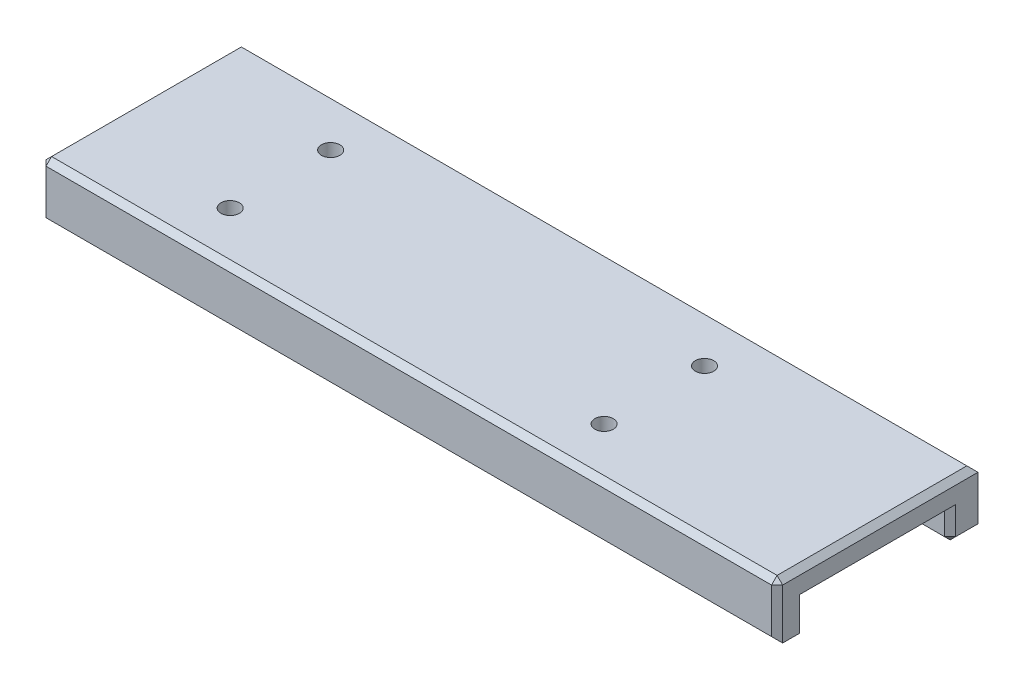
ISO-10303-21;
HEADER;
FILE_DESCRIPTION(('STEP AP214'),'2;1');
FILE_NAME('part.step','',(''),(''),'','','');
FILE_SCHEMA(('AUTOMOTIVE_DESIGN { 1 0 10303 214 1 1 1 1 }'));
ENDSEC;
DATA;
#1=APPLICATION_CONTEXT('core data for automotive mechanical design processes');
#2=APPLICATION_PROTOCOL_DEFINITION('international standard','automotive_design',2000,#1);
#3=PRODUCT_CONTEXT('',#1,'mechanical');
#4=PRODUCT('Part','Part','',(#3));
#5=PRODUCT_RELATED_PRODUCT_CATEGORY('part','',(#4));
#6=PRODUCT_DEFINITION_FORMATION('','',#4);
#7=PRODUCT_DEFINITION_CONTEXT('part definition',#1,'design');
#8=PRODUCT_DEFINITION('design','',#6,#7);
#9=PRODUCT_DEFINITION_SHAPE('','',#8);
#10=(LENGTH_UNIT() NAMED_UNIT(*) SI_UNIT(.MILLI.,.METRE.));
#11=(NAMED_UNIT(*) PLANE_ANGLE_UNIT() SI_UNIT($,.RADIAN.));
#12=(NAMED_UNIT(*) SI_UNIT($,.STERADIAN.) SOLID_ANGLE_UNIT());
#13=UNCERTAINTY_MEASURE_WITH_UNIT(LENGTH_MEASURE(1.E-05),#10,'distance_accuracy_value','');
#14=(GEOMETRIC_REPRESENTATION_CONTEXT(3) GLOBAL_UNCERTAINTY_ASSIGNED_CONTEXT((#13)) GLOBAL_UNIT_ASSIGNED_CONTEXT((#10,
#11,#12)) REPRESENTATION_CONTEXT('',''));
#15=CARTESIAN_POINT('',(0.,0.,0.));
#16=DIRECTION('',(0.,0.,1.));
#17=DIRECTION('',(1.,0.,0.));
#18=AXIS2_PLACEMENT_3D('',#15,#16,#17);
#19=CARTESIAN_POINT('',(0.,-5.,0.));
#20=DIRECTION('',(0.,-1.,0.));
#21=DIRECTION('',(0.,0.,-1.));
#22=AXIS2_PLACEMENT_3D('',#19,#20,#21);
#23=PLANE('',#22);
#24=DIRECTION('',(0.,0.,1.));
#25=VECTOR('',#24,1.);
#26=CARTESIAN_POINT('',(-66.,-5.,18.));
#27=LINE('',#26,#25);
#28=CARTESIAN_POINT('',(-66.,-5.,14.));
#29=VERTEX_POINT('',#28);
#30=CARTESIAN_POINT('',(-66.,-5.,17.));
#31=VERTEX_POINT('',#30);
#32=EDGE_CURVE('E188',#29,#31,#27,.T.);
#33=ORIENTED_EDGE('',*,*,#32,.F.);
#34=DIRECTION('',(1.,0.,0.));
#35=VECTOR('',#34,1.);
#36=CARTESIAN_POINT('',(66.,-5.,14.));
#37=LINE('',#36,#35);
#38=CARTESIAN_POINT('',(66.,-5.,14.));
#39=VERTEX_POINT('',#38);
#40=EDGE_CURVE('E173',#29,#39,#37,.T.);
#41=ORIENTED_EDGE('',*,*,#40,.T.);
#42=DIRECTION('',(0.,0.,-1.));
#43=VECTOR('',#42,1.);
#44=CARTESIAN_POINT('',(66.,-5.,18.));
#45=LINE('',#44,#43);
#46=CARTESIAN_POINT('',(66.,-5.,17.));
#47=VERTEX_POINT('',#46);
#48=EDGE_CURVE('E204',#47,#39,#45,.T.);
#49=ORIENTED_EDGE('',*,*,#48,.F.);
#50=DIRECTION('',(-1.,0.,0.));
#51=VECTOR('',#50,1.);
#52=CARTESIAN_POINT('',(-66.,-5.,17.));
#53=LINE('',#52,#51);
#54=EDGE_CURVE('E182',#47,#31,#53,.T.);
#55=ORIENTED_EDGE('',*,*,#54,.T.);
#56=EDGE_LOOP('',(#33,#41,#49,#55));
#57=FACE_BOUND('',#56,.T.);
#58=ADVANCED_FACE('F35',(#57),#23,.T.);
#59=CARTESIAN_POINT('',(66.,5.,18.));
#60=DIRECTION('',(-1.,0.,0.));
#61=DIRECTION('',(0.,0.,1.));
#62=AXIS2_PLACEMENT_3D('',#59,#60,#61);
#63=PLANE('',#62);
#64=DIRECTION('',(0.,-1.,0.));
#65=VECTOR('',#64,1.);
#66=CARTESIAN_POINT('',(66.,5.,-14.));
#67=LINE('',#66,#65);
#68=CARTESIAN_POINT('',(66.,1.00000000000001,-14.));
#69=VERTEX_POINT('',#68);
#70=CARTESIAN_POINT('',(66.,-3.99999999999999,-14.));
#71=VERTEX_POINT('',#70);
#72=EDGE_CURVE('E252',#69,#71,#67,.T.);
#73=ORIENTED_EDGE('',*,*,#72,.T.);
#74=DIRECTION('',(0.,0.,-1.));
#75=VECTOR('',#74,1.);
#76=CARTESIAN_POINT('',(66.,-3.99999999999999,-18.));
#77=LINE('',#76,#75);
#78=CARTESIAN_POINT('',(66.,-3.99999999999998,-18.));
#79=VERTEX_POINT('',#78);
#80=EDGE_CURVE('E254',#71,#79,#77,.T.);
#81=ORIENTED_EDGE('',*,*,#80,.T.);
#82=DIRECTION('',(0.,-1.,0.));
#83=VECTOR('',#82,1.);
#84=CARTESIAN_POINT('',(66.,5.,-18.));
#85=LINE('',#84,#83);
#86=CARTESIAN_POINT('',(66.,4.,-18.));
#87=VERTEX_POINT('',#86);
#88=EDGE_CURVE('E201',#87,#79,#85,.T.);
#89=ORIENTED_EDGE('',*,*,#88,.F.);
#90=DIRECTION('',(0.,0.,1.));
#91=VECTOR('',#90,1.);
#92=CARTESIAN_POINT('',(66.,4.,18.));
#93=LINE('',#92,#91);
#94=CARTESIAN_POINT('',(66.,4.,17.));
#95=VERTEX_POINT('',#94);
#96=EDGE_CURVE('E181',#87,#95,#93,.T.);
#97=ORIENTED_EDGE('',*,*,#96,.T.);
#98=DIRECTION('',(0.,-1.,0.));
#99=VECTOR('',#98,1.);
#100=CARTESIAN_POINT('',(66.,5.,17.));
#101=LINE('',#100,#99);
#102=EDGE_CURVE('E246',#95,#47,#101,.T.);
#103=ORIENTED_EDGE('',*,*,#102,.T.);
#104=ORIENTED_EDGE('',*,*,#48,.T.);
#105=DIRECTION('',(0.,1.,0.));
#106=VECTOR('',#105,1.);
#107=CARTESIAN_POINT('',(66.,5.,14.));
#108=LINE('',#107,#106);
#109=CARTESIAN_POINT('',(66.,1.00000000000001,14.));
#110=VERTEX_POINT('',#109);
#111=EDGE_CURVE('E248',#39,#110,#108,.T.);
#112=ORIENTED_EDGE('',*,*,#111,.T.);
#113=DIRECTION('',(0.,0.,-1.));
#114=VECTOR('',#113,1.);
#115=CARTESIAN_POINT('',(66.,1.00000000000001,18.));
#116=LINE('',#115,#114);
#117=EDGE_CURVE('E250',#110,#69,#116,.T.);
#118=ORIENTED_EDGE('',*,*,#117,.T.);
#119=EDGE_LOOP('',(#73,#81,#89,#97,#103,#104,#112,#118));
#120=FACE_BOUND('',#119,.T.);
#121=ADVANCED_FACE('F369',(#120),#63,.F.);
#122=CARTESIAN_POINT('',(-66.,5.,-18.));
#123=DIRECTION('',(0.,0.,1.));
#124=DIRECTION('',(1.,0.,0.));
#125=AXIS2_PLACEMENT_3D('',#122,#123,#124);
#126=PLANE('',#125);
#127=DIRECTION('',(-1.,0.,0.));
#128=VECTOR('',#127,1.);
#129=CARTESIAN_POINT('',(-66.,-5.,-18.));
#130=LINE('',#129,#128);
#131=CARTESIAN_POINT('',(65.,-5.,-18.));
#132=VERTEX_POINT('',#131);
#133=CARTESIAN_POINT('',(-65.,-5.,-18.));
#134=VERTEX_POINT('',#133);
#135=EDGE_CURVE('E198',#132,#134,#130,.T.);
#136=ORIENTED_EDGE('',*,*,#135,.T.);
#137=DIRECTION('',(-0.707106781186543,0.707106781186552,0.));
#138=VECTOR('',#137,1.);
#139=CARTESIAN_POINT('',(-66.,-3.99999999999997,-18.));
#140=LINE('',#139,#138);
#141=CARTESIAN_POINT('',(-66.,-3.99999999999997,-18.));
#142=VERTEX_POINT('',#141);
#143=EDGE_CURVE('E232',#134,#142,#140,.T.);
#144=ORIENTED_EDGE('',*,*,#143,.T.);
#145=DIRECTION('',(0.,-1.,0.));
#146=VECTOR('',#145,1.);
#147=CARTESIAN_POINT('',(-66.,5.,-18.));
#148=LINE('',#147,#146);
#149=CARTESIAN_POINT('',(-66.,4.,-18.));
#150=VERTEX_POINT('',#149);
#151=EDGE_CURVE('E197',#150,#142,#148,.T.);
#152=ORIENTED_EDGE('',*,*,#151,.F.);
#153=DIRECTION('',(1.,0.,0.));
#154=VECTOR('',#153,1.);
#155=CARTESIAN_POINT('',(-66.,4.,-18.));
#156=LINE('',#155,#154);
#157=EDGE_CURVE('E228',#150,#87,#156,.T.);
#158=ORIENTED_EDGE('',*,*,#157,.T.);
#159=ORIENTED_EDGE('',*,*,#88,.T.);
#160=DIRECTION('',(-0.707106781186552,-0.707106781186543,0.));
#161=VECTOR('',#160,1.);
#162=CARTESIAN_POINT('',(66.,-3.99999999999999,-18.));
#163=LINE('',#162,#161);
#164=EDGE_CURVE('E230',#79,#132,#163,.T.);
#165=ORIENTED_EDGE('',*,*,#164,.T.);
#166=EDGE_LOOP('',(#136,#144,#152,#158,#159,#165));
#167=FACE_BOUND('',#166,.T.);
#168=ADVANCED_FACE('F375',(#167),#126,.F.);
#169=CARTESIAN_POINT('',(-66.,5.,18.));
#170=DIRECTION('',(1.,0.,0.));
#171=DIRECTION('',(0.,0.,-1.));
#172=AXIS2_PLACEMENT_3D('',#169,#170,#171);
#173=PLANE('',#172);
#174=DIRECTION('',(0.,0.,1.));
#175=VECTOR('',#174,1.);
#176=CARTESIAN_POINT('',(-66.,1.00000000000003,18.));
#177=LINE('',#176,#175);
#178=CARTESIAN_POINT('',(-66.,1.00000000000003,-14.));
#179=VERTEX_POINT('',#178);
#180=CARTESIAN_POINT('',(-66.,1.00000000000003,14.));
#181=VERTEX_POINT('',#180);
#182=EDGE_CURVE('E191',#179,#181,#177,.T.);
#183=ORIENTED_EDGE('',*,*,#182,.T.);
#184=DIRECTION('',(0.,-1.,0.));
#185=VECTOR('',#184,1.);
#186=CARTESIAN_POINT('',(-66.,5.,14.));
#187=LINE('',#186,#185);
#188=EDGE_CURVE('E164',#181,#29,#187,.T.);
#189=ORIENTED_EDGE('',*,*,#188,.T.);
#190=ORIENTED_EDGE('',*,*,#32,.T.);
#191=DIRECTION('',(0.,1.,0.));
#192=VECTOR('',#191,1.);
#193=CARTESIAN_POINT('',(-66.,5.,17.));
#194=LINE('',#193,#192);
#195=CARTESIAN_POINT('',(-66.,4.,17.));
#196=VERTEX_POINT('',#195);
#197=EDGE_CURVE('E212',#31,#196,#194,.T.);
#198=ORIENTED_EDGE('',*,*,#197,.T.);
#199=DIRECTION('',(0.,0.,-1.));
#200=VECTOR('',#199,1.);
#201=CARTESIAN_POINT('',(-66.,4.,18.));
#202=LINE('',#201,#200);
#203=EDGE_CURVE('E210',#196,#150,#202,.T.);
#204=ORIENTED_EDGE('',*,*,#203,.T.);
#205=ORIENTED_EDGE('',*,*,#151,.T.);
#206=DIRECTION('',(0.,0.,1.));
#207=VECTOR('',#206,1.);
#208=CARTESIAN_POINT('',(-66.,-3.99999999999997,-13.));
#209=LINE('',#208,#207);
#210=CARTESIAN_POINT('',(-66.,-3.99999999999997,-14.));
#211=VERTEX_POINT('',#210);
#212=EDGE_CURVE('E194',#142,#211,#209,.T.);
#213=ORIENTED_EDGE('',*,*,#212,.T.);
#214=DIRECTION('',(0.,1.,0.));
#215=VECTOR('',#214,1.);
#216=CARTESIAN_POINT('',(-66.,5.,-14.));
#217=LINE('',#216,#215);
#218=EDGE_CURVE('E214',#211,#179,#217,.T.);
#219=ORIENTED_EDGE('',*,*,#218,.T.);
#220=EDGE_LOOP('',(#183,#189,#190,#198,#204,#205,#213,#219));
#221=FACE_BOUND('',#220,.T.);
#222=ADVANCED_FACE('F186',(#221),#173,.F.);
#223=CARTESIAN_POINT('',(-66.,5.,18.));
#224=DIRECTION('',(0.,0.,-1.));
#225=DIRECTION('',(-1.,0.,0.));
#226=AXIS2_PLACEMENT_3D('',#223,#224,#225);
#227=PLANE('',#226);
#228=DIRECTION('',(-1.,0.,0.));
#229=VECTOR('',#228,1.);
#230=CARTESIAN_POINT('',(-66.,4.,18.));
#231=LINE('',#230,#229);
#232=CARTESIAN_POINT('',(65.,4.,18.));
#233=VERTEX_POINT('',#232);
#234=CARTESIAN_POINT('',(-65.,4.,18.));
#235=VERTEX_POINT('',#234);
#236=EDGE_CURVE('E256',#233,#235,#231,.T.);
#237=ORIENTED_EDGE('',*,*,#236,.T.);
#238=DIRECTION('',(0.,-1.,0.));
#239=VECTOR('',#238,1.);
#240=CARTESIAN_POINT('',(-65.,5.,18.));
#241=LINE('',#240,#239);
#242=CARTESIAN_POINT('',(-65.,-4.,18.));
#243=VERTEX_POINT('',#242);
#244=EDGE_CURVE('E262',#235,#243,#241,.T.);
#245=ORIENTED_EDGE('',*,*,#244,.T.);
#246=DIRECTION('',(1.,0.,0.));
#247=VECTOR('',#246,1.);
#248=CARTESIAN_POINT('',(66.,-4.,18.));
#249=LINE('',#248,#247);
#250=CARTESIAN_POINT('',(65.,-4.,18.));
#251=VERTEX_POINT('',#250);
#252=EDGE_CURVE('E260',#243,#251,#249,.T.);
#253=ORIENTED_EDGE('',*,*,#252,.T.);
#254=DIRECTION('',(0.,1.,0.));
#255=VECTOR('',#254,1.);
#256=CARTESIAN_POINT('',(65.,5.,18.));
#257=LINE('',#256,#255);
#258=EDGE_CURVE('E258',#251,#233,#257,.T.);
#259=ORIENTED_EDGE('',*,*,#258,.T.);
#260=EDGE_LOOP('',(#237,#245,#253,#259));
#261=FACE_BOUND('',#260,.T.);
#262=ADVANCED_FACE('F352',(#261),#227,.F.);
#263=CARTESIAN_POINT('',(0.,5.,0.));
#264=DIRECTION('',(0.,-1.,0.));
#265=DIRECTION('',(0.,0.,-1.));
#266=AXIS2_PLACEMENT_3D('',#263,#264,#265);
#267=PLANE('',#266);
#268=CARTESIAN_POINT('',(-40.9999999999999,5.00000000000001,-8.99999999999998));
#269=DIRECTION('',(0.,1.,0.));
#270=DIRECTION('',(0.,0.,1.));
#271=AXIS2_PLACEMENT_3D('',#268,#269,#270);
#272=CIRCLE('',#271,1.64999999999999);
#273=CARTESIAN_POINT('',(-40.9999999999999,5.00000000000001,-7.34999999999999));
#274=VERTEX_POINT('',#273);
#275=EDGE_CURVE('E748',#274,#274,#272,.T.);
#276=ORIENTED_EDGE('',*,*,#275,.F.);
#277=EDGE_LOOP('',(#276));
#278=FACE_BOUND('',#277,.T.);
#279=CARTESIAN_POINT('',(26.0000000000001,5.00000000000001,-8.99999999999998));
#280=DIRECTION('',(0.,1.,0.));
#281=DIRECTION('',(0.,0.,1.));
#282=AXIS2_PLACEMENT_3D('',#279,#280,#281);
#283=CIRCLE('',#282,1.64999999999999);
#284=CARTESIAN_POINT('',(26.0000000000001,5.00000000000001,-7.34999999999999));
#285=VERTEX_POINT('',#284);
#286=EDGE_CURVE('E744',#285,#285,#283,.T.);
#287=ORIENTED_EDGE('',*,*,#286,.F.);
#288=EDGE_LOOP('',(#287));
#289=FACE_BOUND('',#288,.T.);
#290=CARTESIAN_POINT('',(-40.9999999999999,5.00000000000001,9.00000000000001));
#291=DIRECTION('',(0.,1.,0.));
#292=DIRECTION('',(0.,0.,1.));
#293=AXIS2_PLACEMENT_3D('',#290,#291,#292);
#294=CIRCLE('',#293,1.64999999999999);
#295=CARTESIAN_POINT('',(-40.9999999999999,5.00000000000001,10.65));
#296=VERTEX_POINT('',#295);
#297=EDGE_CURVE('E740',#296,#296,#294,.T.);
#298=ORIENTED_EDGE('',*,*,#297,.F.);
#299=EDGE_LOOP('',(#298));
#300=FACE_BOUND('',#299,.T.);
#301=CARTESIAN_POINT('',(26.0000000000001,5.00000000000001,9.00000000000001));
#302=DIRECTION('',(0.,1.,0.));
#303=DIRECTION('',(0.,0.,1.));
#304=AXIS2_PLACEMENT_3D('',#301,#302,#303);
#305=CIRCLE('',#304,1.64999999999999);
#306=CARTESIAN_POINT('',(26.0000000000001,5.00000000000001,10.65));
#307=VERTEX_POINT('',#306);
#308=EDGE_CURVE('E736',#307,#307,#305,.T.);
#309=ORIENTED_EDGE('',*,*,#308,.F.);
#310=EDGE_LOOP('',(#309));
#311=FACE_BOUND('',#310,.T.);
#312=DIRECTION('',(1.,0.,0.));
#313=VECTOR('',#312,1.);
#314=CARTESIAN_POINT('',(0.,5.,17.));
#315=LINE('',#314,#313);
#316=CARTESIAN_POINT('',(-65.,5.,17.));
#317=VERTEX_POINT('',#316);
#318=CARTESIAN_POINT('',(65.,5.,17.));
#319=VERTEX_POINT('',#318);
#320=EDGE_CURVE('E265',#317,#319,#315,.T.);
#321=ORIENTED_EDGE('',*,*,#320,.T.);
#322=DIRECTION('',(0.,0.,-1.));
#323=VECTOR('',#322,1.);
#324=CARTESIAN_POINT('',(65.,5.,0.));
#325=LINE('',#324,#323);
#326=CARTESIAN_POINT('',(65.,5.,-17.));
#327=VERTEX_POINT('',#326);
#328=EDGE_CURVE('E11',#319,#327,#325,.T.);
#329=ORIENTED_EDGE('',*,*,#328,.T.);
#330=DIRECTION('',(-1.,0.,0.));
#331=VECTOR('',#330,1.);
#332=CARTESIAN_POINT('',(0.,5.,-17.));
#333=LINE('',#332,#331);
#334=CARTESIAN_POINT('',(-65.,5.,-17.));
#335=VERTEX_POINT('',#334);
#336=EDGE_CURVE('E44',#327,#335,#333,.T.);
#337=ORIENTED_EDGE('',*,*,#336,.T.);
#338=DIRECTION('',(0.,0.,1.));
#339=VECTOR('',#338,1.);
#340=CARTESIAN_POINT('',(-65.,5.,0.));
#341=LINE('',#340,#339);
#342=EDGE_CURVE('E267',#335,#317,#341,.T.);
#343=ORIENTED_EDGE('',*,*,#342,.T.);
#344=EDGE_LOOP('',(#321,#329,#337,#343));
#345=FACE_BOUND('',#344,.T.);
#346=ADVANCED_FACE('F331',(#278,#289,#300,#311,#345),#267,.F.);
#347=DIRECTION('',(-1.,0.,0.));
#348=VECTOR('',#347,1.);
#349=CARTESIAN_POINT('',(-66.,-5.,-14.));
#350=LINE('',#349,#348);
#351=CARTESIAN_POINT('',(65.,-5.,-14.));
#352=VERTEX_POINT('',#351);
#353=CARTESIAN_POINT('',(-65.,-5.,-14.));
#354=VERTEX_POINT('',#353);
#355=EDGE_CURVE('E224',#352,#354,#350,.T.);
#356=ORIENTED_EDGE('',*,*,#355,.T.);
#357=DIRECTION('',(0.,0.,-1.));
#358=VECTOR('',#357,1.);
#359=CARTESIAN_POINT('',(-65.,-5.,-18.));
#360=LINE('',#359,#358);
#361=EDGE_CURVE('E226',#354,#134,#360,.T.);
#362=ORIENTED_EDGE('',*,*,#361,.T.);
#363=ORIENTED_EDGE('',*,*,#135,.F.);
#364=DIRECTION('',(0.,0.,1.));
#365=VECTOR('',#364,1.);
#366=CARTESIAN_POINT('',(65.,-5.,-13.));
#367=LINE('',#366,#365);
#368=EDGE_CURVE('E222',#132,#352,#367,.T.);
#369=ORIENTED_EDGE('',*,*,#368,.T.);
#370=EDGE_LOOP('',(#356,#362,#363,#369));
#371=FACE_BOUND('',#370,.T.);
#372=ADVANCED_FACE('F371',(#371),#23,.T.);
#373=CARTESIAN_POINT('',(-66.,-5.,13.));
#374=DIRECTION('',(0.,0.,1.));
#375=DIRECTION('',(1.,0.,0.));
#376=AXIS2_PLACEMENT_3D('',#373,#374,#375);
#377=PLANE('',#376);
#378=DIRECTION('',(-1.,0.,0.));
#379=VECTOR('',#378,1.);
#380=CARTESIAN_POINT('',(-66.,-3.99999999999997,13.));
#381=LINE('',#380,#379);
#382=CARTESIAN_POINT('',(65.,-3.99999999999997,13.));
#383=VERTEX_POINT('',#382);
#384=CARTESIAN_POINT('',(-65.,-3.99999999999997,13.));
#385=VERTEX_POINT('',#384);
#386=EDGE_CURVE('E219',#383,#385,#381,.T.);
#387=ORIENTED_EDGE('',*,*,#386,.T.);
#388=DIRECTION('',(0.,1.,0.));
#389=VECTOR('',#388,1.);
#390=CARTESIAN_POINT('',(-65.,-5.,13.));
#391=LINE('',#390,#389);
#392=CARTESIAN_POINT('',(-65.,0.,13.));
#393=VERTEX_POINT('',#392);
#394=EDGE_CURVE('E166',#385,#393,#391,.T.);
#395=ORIENTED_EDGE('',*,*,#394,.T.);
#396=DIRECTION('',(1.,0.,0.));
#397=VECTOR('',#396,1.);
#398=CARTESIAN_POINT('',(-66.,0.,13.));
#399=LINE('',#398,#397);
#400=CARTESIAN_POINT('',(65.,0.,13.));
#401=VERTEX_POINT('',#400);
#402=EDGE_CURVE('E439',#393,#401,#399,.T.);
#403=ORIENTED_EDGE('',*,*,#402,.T.);
#404=DIRECTION('',(0.,-1.,0.));
#405=VECTOR('',#404,1.);
#406=CARTESIAN_POINT('',(65.,-5.,13.));
#407=LINE('',#406,#405);
#408=EDGE_CURVE('E193',#401,#383,#407,.T.);
#409=ORIENTED_EDGE('',*,*,#408,.T.);
#410=EDGE_LOOP('',(#387,#395,#403,#409));
#411=FACE_BOUND('',#410,.T.);
#412=ADVANCED_FACE('F381',(#411),#377,.F.);
#413=CARTESIAN_POINT('',(-66.,0.,13.));
#414=DIRECTION('',(0.,1.,0.));
#415=DIRECTION('',(0.,0.,1.));
#416=AXIS2_PLACEMENT_3D('',#413,#414,#415);
#417=PLANE('',#416);
#418=CARTESIAN_POINT('',(-40.9999999999999,0.,-8.99999999999998));
#419=DIRECTION('',(0.,1.,0.));
#420=DIRECTION('',(0.,0.,1.));
#421=AXIS2_PLACEMENT_3D('',#418,#419,#420);
#422=CIRCLE('',#421,1.64999999999999);
#423=CARTESIAN_POINT('',(-40.9999999999999,0.,-7.34999999999999));
#424=VERTEX_POINT('',#423);
#425=EDGE_CURVE('E725',#424,#424,#422,.T.);
#426=ORIENTED_EDGE('',*,*,#425,.T.);
#427=EDGE_LOOP('',(#426));
#428=FACE_BOUND('',#427,.T.);
#429=CARTESIAN_POINT('',(26.0000000000001,0.,-8.99999999999998));
#430=DIRECTION('',(0.,1.,0.));
#431=DIRECTION('',(0.,0.,1.));
#432=AXIS2_PLACEMENT_3D('',#429,#430,#431);
#433=CIRCLE('',#432,1.64999999999999);
#434=CARTESIAN_POINT('',(26.0000000000001,0.,-7.34999999999999));
#435=VERTEX_POINT('',#434);
#436=EDGE_CURVE('E729',#435,#435,#433,.T.);
#437=ORIENTED_EDGE('',*,*,#436,.T.);
#438=EDGE_LOOP('',(#437));
#439=FACE_BOUND('',#438,.T.);
#440=CARTESIAN_POINT('',(-40.9999999999999,0.,9.00000000000001));
#441=DIRECTION('',(0.,1.,0.));
#442=DIRECTION('',(0.,0.,1.));
#443=AXIS2_PLACEMENT_3D('',#440,#441,#442);
#444=CIRCLE('',#443,1.64999999999999);
#445=CARTESIAN_POINT('',(-40.9999999999999,0.,10.65));
#446=VERTEX_POINT('',#445);
#447=EDGE_CURVE('E39',#446,#446,#444,.T.);
#448=ORIENTED_EDGE('',*,*,#447,.T.);
#449=EDGE_LOOP('',(#448));
#450=FACE_BOUND('',#449,.T.);
#451=CARTESIAN_POINT('',(26.0000000000001,0.,9.00000000000001));
#452=DIRECTION('',(0.,1.,0.));
#453=DIRECTION('',(0.,0.,1.));
#454=AXIS2_PLACEMENT_3D('',#451,#452,#453);
#455=CIRCLE('',#454,1.64999999999999);
#456=CARTESIAN_POINT('',(26.0000000000001,0.,10.65));
#457=VERTEX_POINT('',#456);
#458=EDGE_CURVE('E303',#457,#457,#455,.T.);
#459=ORIENTED_EDGE('',*,*,#458,.T.);
#460=EDGE_LOOP('',(#459));
#461=FACE_BOUND('',#460,.T.);
#462=ORIENTED_EDGE('',*,*,#402,.F.);
#463=DIRECTION('',(0.,0.,-1.));
#464=VECTOR('',#463,1.);
#465=CARTESIAN_POINT('',(-65.,0.,13.));
#466=LINE('',#465,#464);
#467=CARTESIAN_POINT('',(-65.,0.,-13.));
#468=VERTEX_POINT('',#467);
#469=EDGE_CURVE('E236',#393,#468,#466,.T.);
#470=ORIENTED_EDGE('',*,*,#469,.T.);
#471=DIRECTION('',(1.,0.,0.));
#472=VECTOR('',#471,1.);
#473=CARTESIAN_POINT('',(-66.,0.,-13.));
#474=LINE('',#473,#472);
#475=CARTESIAN_POINT('',(65.,0.,-13.));
#476=VERTEX_POINT('',#475);
#477=EDGE_CURVE('E299',#468,#476,#474,.T.);
#478=ORIENTED_EDGE('',*,*,#477,.T.);
#479=DIRECTION('',(0.,0.,1.));
#480=VECTOR('',#479,1.);
#481=CARTESIAN_POINT('',(65.,0.,13.));
#482=LINE('',#481,#480);
#483=EDGE_CURVE('E234',#476,#401,#482,.T.);
#484=ORIENTED_EDGE('',*,*,#483,.T.);
#485=EDGE_LOOP('',(#462,#470,#478,#484));
#486=FACE_BOUND('',#485,.T.);
#487=ADVANCED_FACE('F387',(#428,#439,#450,#461,#486),#417,.F.);
#488=CARTESIAN_POINT('',(-66.,0.,-13.));
#489=DIRECTION('',(0.,0.,-1.));
#490=DIRECTION('',(-1.,0.,0.));
#491=AXIS2_PLACEMENT_3D('',#488,#489,#490);
#492=PLANE('',#491);
#493=ORIENTED_EDGE('',*,*,#477,.F.);
#494=DIRECTION('',(0.,-1.,0.));
#495=VECTOR('',#494,1.);
#496=CARTESIAN_POINT('',(-65.,0.,-13.));
#497=LINE('',#496,#495);
#498=CARTESIAN_POINT('',(-65.,-3.99999999999997,-13.));
#499=VERTEX_POINT('',#498);
#500=EDGE_CURVE('E242',#468,#499,#497,.T.);
#501=ORIENTED_EDGE('',*,*,#500,.T.);
#502=DIRECTION('',(1.,0.,0.));
#503=VECTOR('',#502,1.);
#504=CARTESIAN_POINT('',(66.,-3.99999999999997,-13.));
#505=LINE('',#504,#503);
#506=CARTESIAN_POINT('',(65.,-3.99999999999997,-13.));
#507=VERTEX_POINT('',#506);
#508=EDGE_CURVE('E240',#499,#507,#505,.T.);
#509=ORIENTED_EDGE('',*,*,#508,.T.);
#510=DIRECTION('',(0.,1.,0.));
#511=VECTOR('',#510,1.);
#512=CARTESIAN_POINT('',(65.,0.,-13.));
#513=LINE('',#512,#511);
#514=EDGE_CURVE('E238',#507,#476,#513,.T.);
#515=ORIENTED_EDGE('',*,*,#514,.T.);
#516=EDGE_LOOP('',(#493,#501,#509,#515));
#517=FACE_BOUND('',#516,.T.);
#518=ADVANCED_FACE('F434',(#517),#492,.F.);
#519=CARTESIAN_POINT('',(66.,-3.99999999999999,18.));
#520=DIRECTION('',(0.707106781186543,-0.707106781186552,0.));
#521=DIRECTION('',(0.,0.,1.));
#522=AXIS2_PLACEMENT_3D('',#519,#520,#521);
#523=PLANE('',#522);
#524=DIRECTION('',(0.707106781186552,0.707106781186543,0.));
#525=VECTOR('',#524,1.);
#526=CARTESIAN_POINT('',(65.5,-4.49999999999999,-14.));
#527=LINE('',#526,#525);
#528=EDGE_CURVE('E296',#352,#71,#527,.T.);
#529=ORIENTED_EDGE('',*,*,#528,.F.);
#530=ORIENTED_EDGE('',*,*,#368,.F.);
#531=ORIENTED_EDGE('',*,*,#164,.F.);
#532=ORIENTED_EDGE('',*,*,#80,.F.);
#533=EDGE_LOOP('',(#529,#530,#531,#532));
#534=FACE_BOUND('',#533,.T.);
#535=ADVANCED_FACE('F419',(#534),#523,.T.);
#536=CARTESIAN_POINT('',(65.,-3.99999999999997,-13.));
#537=DIRECTION('',(0.577350269189618,-0.577350269189626,0.577350269189634));
#538=DIRECTION('',(0.,-0.707106781186552,-0.707106781186543));
#539=AXIS2_PLACEMENT_3D('',#536,#537,#538);
#540=PLANE('',#539);
#541=DIRECTION('',(0.707106781186552,0.,-0.707106781186543));
#542=VECTOR('',#541,1.);
#543=CARTESIAN_POINT('',(65.,-3.99999999999997,-13.));
#544=LINE('',#543,#542);
#545=EDGE_CURVE('E290',#507,#71,#544,.T.);
#546=ORIENTED_EDGE('',*,*,#545,.F.);
#547=DIRECTION('',(0.,-0.707106781186552,-0.707106781186543));
#548=VECTOR('',#547,1.);
#549=CARTESIAN_POINT('',(65.,-3.99999999999997,-13.));
#550=LINE('',#549,#548);
#551=EDGE_CURVE('E293',#352,#507,#550,.F.);
#552=ORIENTED_EDGE('',*,*,#551,.F.);
#553=ORIENTED_EDGE('',*,*,#528,.T.);
#554=EDGE_LOOP('',(#546,#552,#553));
#555=FACE_BOUND('',#554,.T.);
#556=ADVANCED_FACE('F424',(#555),#540,.T.);
#557=CARTESIAN_POINT('',(-66.,-3.99999999999997,-13.));
#558=DIRECTION('',(0.,-0.707106781186543,0.707106781186552));
#559=DIRECTION('',(-1.,0.,0.));
#560=AXIS2_PLACEMENT_3D('',#557,#558,#559);
#561=PLANE('',#560);
#562=ORIENTED_EDGE('',*,*,#551,.T.);
#563=ORIENTED_EDGE('',*,*,#508,.F.);
#564=DIRECTION('',(0.,0.707106781186552,0.707106781186543));
#565=VECTOR('',#564,1.);
#566=CARTESIAN_POINT('',(-65.,-4.49999999999999,-13.5));
#567=LINE('',#566,#565);
#568=EDGE_CURVE('E287',#354,#499,#567,.T.);
#569=ORIENTED_EDGE('',*,*,#568,.F.);
#570=ORIENTED_EDGE('',*,*,#355,.F.);
#571=EDGE_LOOP('',(#562,#563,#569,#570));
#572=FACE_BOUND('',#571,.T.);
#573=ADVANCED_FACE('F406',(#572),#561,.T.);
#574=CARTESIAN_POINT('',(-66.,-3.99999999999997,18.));
#575=DIRECTION('',(-0.707106781186552,-0.707106781186543,0.));
#576=DIRECTION('',(0.,0.,-1.));
#577=AXIS2_PLACEMENT_3D('',#574,#575,#576);
#578=PLANE('',#577);
#579=ORIENTED_EDGE('',*,*,#143,.F.);
#580=ORIENTED_EDGE('',*,*,#361,.F.);
#581=DIRECTION('',(0.707106781186543,-0.707106781186552,0.));
#582=VECTOR('',#581,1.);
#583=CARTESIAN_POINT('',(-66.,-3.99999999999997,-14.));
#584=LINE('',#583,#582);
#585=EDGE_CURVE('E284',#211,#354,#584,.T.);
#586=ORIENTED_EDGE('',*,*,#585,.F.);
#587=ORIENTED_EDGE('',*,*,#212,.F.);
#588=EDGE_LOOP('',(#579,#580,#586,#587));
#589=FACE_BOUND('',#588,.T.);
#590=ADVANCED_FACE('F402',(#589),#578,.T.);
#591=CARTESIAN_POINT('',(65.,0.,-13.));
#592=DIRECTION('',(-0.707106781186543,0.,-0.707106781186552));
#593=DIRECTION('',(0.,1.,0.));
#594=AXIS2_PLACEMENT_3D('',#591,#592,#593);
#595=PLANE('',#594);
#596=ORIENTED_EDGE('',*,*,#545,.T.);
#597=ORIENTED_EDGE('',*,*,#72,.F.);
#598=DIRECTION('',(0.577350269189631,0.577350269189623,-0.577350269189623));
#599=VECTOR('',#598,1.);
#600=CARTESIAN_POINT('',(65.,0.,-13.));
#601=LINE('',#600,#599);
#602=EDGE_CURVE('E281',#476,#69,#601,.T.);
#603=ORIENTED_EDGE('',*,*,#602,.F.);
#604=ORIENTED_EDGE('',*,*,#514,.F.);
#605=EDGE_LOOP('',(#596,#597,#603,#604));
#606=FACE_BOUND('',#605,.T.);
#607=ADVANCED_FACE('F429',(#606),#595,.F.);
#608=CARTESIAN_POINT('',(-66.,-3.99999999999997,-14.));
#609=DIRECTION('',(-0.577350269189634,-0.577350269189618,0.577350269189626));
#610=DIRECTION('',(0.707106781186543,0.,0.707106781186552));
#611=AXIS2_PLACEMENT_3D('',#608,#609,#610);
#612=PLANE('',#611);
#613=ORIENTED_EDGE('',*,*,#585,.T.);
#614=ORIENTED_EDGE('',*,*,#568,.T.);
#615=DIRECTION('',(0.707106781186543,0.,0.707106781186552));
#616=VECTOR('',#615,1.);
#617=CARTESIAN_POINT('',(-66.,-3.99999999999997,-14.));
#618=LINE('',#617,#616);
#619=EDGE_CURVE('E278',#211,#499,#618,.T.);
#620=ORIENTED_EDGE('',*,*,#619,.F.);
#621=EDGE_LOOP('',(#613,#614,#620));
#622=FACE_BOUND('',#621,.T.);
#623=ADVANCED_FACE('F408',(#622),#612,.T.);
#624=CARTESIAN_POINT('',(65.,0.,13.));
#625=DIRECTION('',(-0.707106781186543,0.707106781186552,0.));
#626=DIRECTION('',(0.,0.,1.));
#627=AXIS2_PLACEMENT_3D('',#624,#625,#626);
#628=PLANE('',#627);
#629=ORIENTED_EDGE('',*,*,#602,.T.);
#630=ORIENTED_EDGE('',*,*,#117,.F.);
#631=DIRECTION('',(0.577350269189631,0.577350269189623,0.577350269189623));
#632=VECTOR('',#631,1.);
#633=CARTESIAN_POINT('',(65.,0.,13.));
#634=LINE('',#633,#632);
#635=EDGE_CURVE('E275',#401,#110,#634,.T.);
#636=ORIENTED_EDGE('',*,*,#635,.F.);
#637=ORIENTED_EDGE('',*,*,#483,.F.);
#638=EDGE_LOOP('',(#629,#630,#636,#637));
#639=FACE_BOUND('',#638,.T.);
#640=ADVANCED_FACE('F450',(#639),#628,.F.);
#641=CARTESIAN_POINT('',(-66.,5.,-14.));
#642=DIRECTION('',(0.707106781186552,0.,-0.707106781186543));
#643=DIRECTION('',(0.,1.,0.));
#644=AXIS2_PLACEMENT_3D('',#641,#642,#643);
#645=PLANE('',#644);
#646=ORIENTED_EDGE('',*,*,#619,.T.);
#647=ORIENTED_EDGE('',*,*,#500,.F.);
#648=DIRECTION('',(-0.57735026918962,0.577350269189628,-0.577350269189628));
#649=VECTOR('',#648,1.);
#650=CARTESIAN_POINT('',(-55.3333333333334,-9.66666666666675,-3.33333333333326));
#651=LINE('',#650,#649);
#652=EDGE_CURVE('E272',#179,#468,#651,.F.);
#653=ORIENTED_EDGE('',*,*,#652,.F.);
#654=ORIENTED_EDGE('',*,*,#218,.F.);
#655=EDGE_LOOP('',(#646,#647,#653,#654));
#656=FACE_BOUND('',#655,.T.);
#657=ADVANCED_FACE('F413',(#656),#645,.F.);
#658=CARTESIAN_POINT('',(65.,-5.,13.));
#659=DIRECTION('',(-0.707106781186543,0.,0.707106781186552));
#660=DIRECTION('',(0.,-1.,0.));
#661=AXIS2_PLACEMENT_3D('',#658,#659,#660);
#662=PLANE('',#661);
#663=ORIENTED_EDGE('',*,*,#635,.T.);
#664=ORIENTED_EDGE('',*,*,#111,.F.);
#665=DIRECTION('',(0.577350269189628,-0.577350269189628,0.57735026918962));
#666=VECTOR('',#665,1.);
#667=CARTESIAN_POINT('',(65.3333333333333,-4.33333333333332,13.3333333333333));
#668=LINE('',#667,#666);
#669=EDGE_CURVE('E176',#383,#39,#668,.T.);
#670=ORIENTED_EDGE('',*,*,#669,.F.);
#671=ORIENTED_EDGE('',*,*,#408,.F.);
#672=EDGE_LOOP('',(#663,#664,#670,#671));
#673=FACE_BOUND('',#672,.T.);
#674=ADVANCED_FACE('F446',(#673),#662,.F.);
#675=CARTESIAN_POINT('',(-66.,1.00000000000003,18.));
#676=DIRECTION('',(0.707106781186552,0.707106781186543,0.));
#677=DIRECTION('',(0.,0.,1.));
#678=AXIS2_PLACEMENT_3D('',#675,#676,#677);
#679=PLANE('',#678);
#680=ORIENTED_EDGE('',*,*,#652,.T.);
#681=ORIENTED_EDGE('',*,*,#469,.F.);
#682=DIRECTION('',(-0.577350269189626,0.577350269189634,0.577350269189618));
#683=VECTOR('',#682,1.);
#684=CARTESIAN_POINT('',(-67.3333333333333,2.33333333333339,15.3333333333333));
#685=LINE('',#684,#683);
#686=EDGE_CURVE('E169',#181,#393,#685,.F.);
#687=ORIENTED_EDGE('',*,*,#686,.F.);
#688=ORIENTED_EDGE('',*,*,#182,.F.);
#689=EDGE_LOOP('',(#680,#681,#687,#688));
#690=FACE_BOUND('',#689,.T.);
#691=ADVANCED_FACE('F587',(#690),#679,.F.);
#692=CARTESIAN_POINT('',(0.,-5.,14.));
#693=DIRECTION('',(0.,-0.707106781186543,-0.707106781186552));
#694=DIRECTION('',(-1.,0.,0.));
#695=AXIS2_PLACEMENT_3D('',#692,#693,#694);
#696=PLANE('',#695);
#697=ORIENTED_EDGE('',*,*,#669,.T.);
#698=ORIENTED_EDGE('',*,*,#40,.F.);
#699=DIRECTION('',(-0.577350269189628,-0.577350269189628,0.57735026918962));
#700=VECTOR('',#699,1.);
#701=CARTESIAN_POINT('',(-43.9999999999998,17.0000000000002,-7.99999999999989));
#702=LINE('',#701,#700);
#703=EDGE_CURVE('E160',#385,#29,#702,.T.);
#704=ORIENTED_EDGE('',*,*,#703,.F.);
#705=ORIENTED_EDGE('',*,*,#386,.F.);
#706=EDGE_LOOP('',(#697,#698,#704,#705));
#707=FACE_BOUND('',#706,.T.);
#708=ADVANCED_FACE('F174',(#707),#696,.T.);
#709=CARTESIAN_POINT('',(-66.,5.,14.));
#710=DIRECTION('',(0.707106781186543,0.,0.707106781186552));
#711=DIRECTION('',(0.,-1.,0.));
#712=AXIS2_PLACEMENT_3D('',#709,#710,#711);
#713=PLANE('',#712);
#714=ORIENTED_EDGE('',*,*,#686,.T.);
#715=ORIENTED_EDGE('',*,*,#394,.F.);
#716=ORIENTED_EDGE('',*,*,#703,.T.);
#717=ORIENTED_EDGE('',*,*,#188,.F.);
#718=EDGE_LOOP('',(#714,#715,#716,#717));
#719=FACE_BOUND('',#718,.T.);
#720=ADVANCED_FACE('F162',(#719),#713,.F.);
#721=CARTESIAN_POINT('',(65.,5.,0.));
#722=DIRECTION('',(-0.707106781186552,-0.707106781186543,0.));
#723=DIRECTION('',(0.,0.,-1.));
#724=AXIS2_PLACEMENT_3D('',#721,#722,#723);
#725=PLANE('',#724);
#726=DIRECTION('',(0.707106781186543,-0.707106781186552,0.));
#727=VECTOR('',#726,1.);
#728=CARTESIAN_POINT('',(65.5,4.5,17.));
#729=LINE('',#728,#727);
#730=EDGE_CURVE('E323',#95,#319,#729,.F.);
#731=ORIENTED_EDGE('',*,*,#730,.F.);
#732=ORIENTED_EDGE('',*,*,#96,.F.);
#733=DIRECTION('',(0.577350269189623,-0.577350269189631,-0.577350269189623));
#734=VECTOR('',#733,1.);
#735=CARTESIAN_POINT('',(43.3333333333335,26.6666666666668,4.66666666666646));
#736=LINE('',#735,#734);
#737=EDGE_CURVE('E170',#327,#87,#736,.T.);
#738=ORIENTED_EDGE('',*,*,#737,.F.);
#739=ORIENTED_EDGE('',*,*,#328,.F.);
#740=EDGE_LOOP('',(#731,#732,#738,#739));
#741=FACE_BOUND('',#740,.T.);
#742=ADVANCED_FACE('F37',(#741),#725,.F.);
#743=CARTESIAN_POINT('',(0.,5.,-17.));
#744=DIRECTION('',(0.,-0.707106781186543,0.707106781186552));
#745=DIRECTION('',(-1.,0.,0.));
#746=AXIS2_PLACEMENT_3D('',#743,#744,#745);
#747=PLANE('',#746);
#748=ORIENTED_EDGE('',*,*,#737,.T.);
#749=ORIENTED_EDGE('',*,*,#157,.F.);
#750=DIRECTION('',(-0.577350269189623,-0.577350269189631,-0.577350269189623));
#751=VECTOR('',#750,1.);
#752=CARTESIAN_POINT('',(-59.3333333333334,10.6666666666667,-11.3333333333334));
#753=LINE('',#752,#751);
#754=EDGE_CURVE('E320',#335,#150,#753,.T.);
#755=ORIENTED_EDGE('',*,*,#754,.F.);
#756=ORIENTED_EDGE('',*,*,#336,.F.);
#757=EDGE_LOOP('',(#748,#749,#755,#756));
#758=FACE_BOUND('',#757,.T.);
#759=ADVANCED_FACE('F326',(#758),#747,.F.);
#760=CARTESIAN_POINT('',(65.,4.,18.));
#761=DIRECTION('',(0.577350269189626,0.577350269189618,0.577350269189634));
#762=DIRECTION('',(0.707106781186552,0.,-0.707106781186543));
#763=AXIS2_PLACEMENT_3D('',#760,#761,#762);
#764=PLANE('',#763);
#765=DIRECTION('',(-0.707106781186552,0.,0.707106781186543));
#766=VECTOR('',#765,1.);
#767=CARTESIAN_POINT('',(65.,4.,18.));
#768=LINE('',#767,#766);
#769=EDGE_CURVE('E314',#95,#233,#768,.T.);
#770=ORIENTED_EDGE('',*,*,#769,.F.);
#771=ORIENTED_EDGE('',*,*,#730,.T.);
#772=DIRECTION('',(0.,0.707106781186552,-0.707106781186543));
#773=VECTOR('',#772,1.);
#774=CARTESIAN_POINT('',(65.,4.,18.));
#775=LINE('',#774,#773);
#776=EDGE_CURVE('E317',#233,#319,#775,.T.);
#777=ORIENTED_EDGE('',*,*,#776,.F.);
#778=EDGE_LOOP('',(#770,#771,#777));
#779=FACE_BOUND('',#778,.T.);
#780=ADVANCED_FACE('F360',(#779),#764,.T.);
#781=CARTESIAN_POINT('',(-65.,5.,0.));
#782=DIRECTION('',(0.707106781186552,-0.707106781186543,0.));
#783=DIRECTION('',(0.,0.,1.));
#784=AXIS2_PLACEMENT_3D('',#781,#782,#783);
#785=PLANE('',#784);
#786=ORIENTED_EDGE('',*,*,#754,.T.);
#787=ORIENTED_EDGE('',*,*,#203,.F.);
#788=DIRECTION('',(0.707106781186543,0.707106781186552,0.));
#789=VECTOR('',#788,1.);
#790=CARTESIAN_POINT('',(-66.,4.,17.));
#791=LINE('',#790,#789);
#792=EDGE_CURVE('E311',#317,#196,#791,.F.);
#793=ORIENTED_EDGE('',*,*,#792,.F.);
#794=ORIENTED_EDGE('',*,*,#342,.F.);
#795=EDGE_LOOP('',(#786,#787,#793,#794));
#796=FACE_BOUND('',#795,.T.);
#797=ADVANCED_FACE('F343',(#796),#785,.F.);
#798=CARTESIAN_POINT('',(0.,5.,17.));
#799=DIRECTION('',(0.,-0.707106781186543,-0.707106781186552));
#800=DIRECTION('',(1.,0.,0.));
#801=AXIS2_PLACEMENT_3D('',#798,#799,#800);
#802=PLANE('',#801);
#803=ORIENTED_EDGE('',*,*,#776,.T.);
#804=ORIENTED_EDGE('',*,*,#320,.F.);
#805=DIRECTION('',(0.,-0.707106781186552,0.707106781186543));
#806=VECTOR('',#805,1.);
#807=CARTESIAN_POINT('',(-65.,4.5,17.5));
#808=LINE('',#807,#806);
#809=EDGE_CURVE('E308',#235,#317,#808,.F.);
#810=ORIENTED_EDGE('',*,*,#809,.F.);
#811=ORIENTED_EDGE('',*,*,#236,.F.);
#812=EDGE_LOOP('',(#803,#804,#810,#811));
#813=FACE_BOUND('',#812,.T.);
#814=ADVANCED_FACE('F337',(#813),#802,.F.);
#815=CARTESIAN_POINT('',(66.,5.,17.));
#816=DIRECTION('',(-0.707106781186543,0.,-0.707106781186552));
#817=DIRECTION('',(0.,-1.,0.));
#818=AXIS2_PLACEMENT_3D('',#815,#816,#817);
#819=PLANE('',#818);
#820=ORIENTED_EDGE('',*,*,#769,.T.);
#821=ORIENTED_EDGE('',*,*,#258,.F.);
#822=DIRECTION('',(-0.577350269189628,0.577350269189628,0.57735026918962));
#823=VECTOR('',#822,1.);
#824=CARTESIAN_POINT('',(62.6666666666666,-1.66666666666664,20.3333333333333));
#825=LINE('',#824,#823);
#826=EDGE_CURVE('E305',#47,#251,#825,.T.);
#827=ORIENTED_EDGE('',*,*,#826,.F.);
#828=ORIENTED_EDGE('',*,*,#102,.F.);
#829=EDGE_LOOP('',(#820,#821,#827,#828));
#830=FACE_BOUND('',#829,.T.);
#831=ADVANCED_FACE('F358',(#830),#819,.F.);
#832=CARTESIAN_POINT('',(-66.,4.,17.));
#833=DIRECTION('',(-0.577350269189626,0.577350269189618,0.577350269189634));
#834=DIRECTION('',(0.707106781186552,0.,0.707106781186543));
#835=AXIS2_PLACEMENT_3D('',#832,#833,#834);
#836=PLANE('',#835);
#837=ORIENTED_EDGE('',*,*,#809,.T.);
#838=ORIENTED_EDGE('',*,*,#792,.T.);
#839=DIRECTION('',(-0.707106781186552,0.,-0.707106781186543));
#840=VECTOR('',#839,1.);
#841=CARTESIAN_POINT('',(-66.,4.,17.));
#842=LINE('',#841,#840);
#843=EDGE_CURVE('E302',#235,#196,#842,.T.);
#844=ORIENTED_EDGE('',*,*,#843,.F.);
#845=EDGE_LOOP('',(#837,#838,#844));
#846=FACE_BOUND('',#845,.T.);
#847=ADVANCED_FACE('F345',(#846),#836,.T.);
#848=CARTESIAN_POINT('',(-66.,-4.,18.));
#849=DIRECTION('',(0.,-0.707106781186543,0.707106781186552));
#850=DIRECTION('',(-1.,0.,0.));
#851=AXIS2_PLACEMENT_3D('',#848,#849,#850);
#852=PLANE('',#851);
#853=ORIENTED_EDGE('',*,*,#826,.T.);
#854=ORIENTED_EDGE('',*,*,#252,.F.);
#855=DIRECTION('',(0.577350269189628,0.577350269189628,0.57735026918962));
#856=VECTOR('',#855,1.);
#857=CARTESIAN_POINT('',(-65.3333333333333,-4.33333333333334,17.6666666666667));
#858=LINE('',#857,#856);
#859=EDGE_CURVE('E300',#31,#243,#858,.T.);
#860=ORIENTED_EDGE('',*,*,#859,.F.);
#861=ORIENTED_EDGE('',*,*,#54,.F.);
#862=EDGE_LOOP('',(#853,#854,#860,#861));
#863=FACE_BOUND('',#862,.T.);
#864=ADVANCED_FACE('F474',(#863),#852,.T.);
#865=CARTESIAN_POINT('',(-65.,5.,18.));
#866=DIRECTION('',(0.707106781186543,0.,-0.707106781186552));
#867=DIRECTION('',(0.,-1.,0.));
#868=AXIS2_PLACEMENT_3D('',#865,#866,#867);
#869=PLANE('',#868);
#870=ORIENTED_EDGE('',*,*,#843,.T.);
#871=ORIENTED_EDGE('',*,*,#197,.F.);
#872=ORIENTED_EDGE('',*,*,#859,.T.);
#873=ORIENTED_EDGE('',*,*,#244,.F.);
#874=EDGE_LOOP('',(#870,#871,#872,#873));
#875=FACE_BOUND('',#874,.T.);
#876=ADVANCED_FACE('F348',(#875),#869,.F.);
#877=CARTESIAN_POINT('',(26.0000000000001,5.,9.00000000000001));
#878=DIRECTION('',(0.,1.,0.));
#879=DIRECTION('',(0.,0.,1.));
#880=AXIS2_PLACEMENT_3D('',#877,#878,#879);
#881=CYLINDRICAL_SURFACE('',#880,1.64999999999999);
#882=ORIENTED_EDGE('',*,*,#308,.T.);
#883=EDGE_LOOP('',(#882));
#884=FACE_BOUND('',#883,.T.);
#885=ORIENTED_EDGE('',*,*,#458,.F.);
#886=EDGE_LOOP('',(#885));
#887=FACE_BOUND('',#886,.T.);
#888=ADVANCED_FACE('F473',(#884,#887),#881,.F.);
#889=CARTESIAN_POINT('',(-40.9999999999999,5.,9.00000000000001));
#890=DIRECTION('',(0.,1.,0.));
#891=DIRECTION('',(0.,0.,1.));
#892=AXIS2_PLACEMENT_3D('',#889,#890,#891);
#893=CYLINDRICAL_SURFACE('',#892,1.64999999999999);
#894=ORIENTED_EDGE('',*,*,#297,.T.);
#895=EDGE_LOOP('',(#894));
#896=FACE_BOUND('',#895,.T.);
#897=ORIENTED_EDGE('',*,*,#447,.F.);
#898=EDGE_LOOP('',(#897));
#899=FACE_BOUND('',#898,.T.);
#900=ADVANCED_FACE('F509',(#896,#899),#893,.F.);
#901=CARTESIAN_POINT('',(26.0000000000001,5.,-8.99999999999998));
#902=DIRECTION('',(0.,1.,0.));
#903=DIRECTION('',(0.,0.,1.));
#904=AXIS2_PLACEMENT_3D('',#901,#902,#903);
#905=CYLINDRICAL_SURFACE('',#904,1.64999999999999);
#906=ORIENTED_EDGE('',*,*,#286,.T.);
#907=EDGE_LOOP('',(#906));
#908=FACE_BOUND('',#907,.T.);
#909=ORIENTED_EDGE('',*,*,#436,.F.);
#910=EDGE_LOOP('',(#909));
#911=FACE_BOUND('',#910,.T.);
#912=ADVANCED_FACE('F518',(#908,#911),#905,.F.);
#913=CARTESIAN_POINT('',(-40.9999999999999,5.,-8.99999999999998));
#914=DIRECTION('',(0.,1.,0.));
#915=DIRECTION('',(0.,0.,1.));
#916=AXIS2_PLACEMENT_3D('',#913,#914,#915);
#917=CYLINDRICAL_SURFACE('',#916,1.64999999999999);
#918=ORIENTED_EDGE('',*,*,#275,.T.);
#919=EDGE_LOOP('',(#918));
#920=FACE_BOUND('',#919,.T.);
#921=ORIENTED_EDGE('',*,*,#425,.F.);
#922=EDGE_LOOP('',(#921));
#923=FACE_BOUND('',#922,.T.);
#924=ADVANCED_FACE('F526',(#920,#923),#917,.F.);
#925=CLOSED_SHELL('',(#58,#121,#168,#222,#262,#346,#372,#412,#487,#518,#535,#556,#573,#590,#607,
#623,#640,#657,#674,#691,#708,#720,#742,#759,#780,#797,#814,#831,#847,#864,#876,#888,#900,#912,#924));
#926=MANIFOLD_SOLID_BREP('B2',#925);
#927=ADVANCED_BREP_SHAPE_REPRESENTATION('',(#18,#926),#14);
#928=SHAPE_DEFINITION_REPRESENTATION(#9,#927);
ENDSEC;
END-ISO-10303-21;
